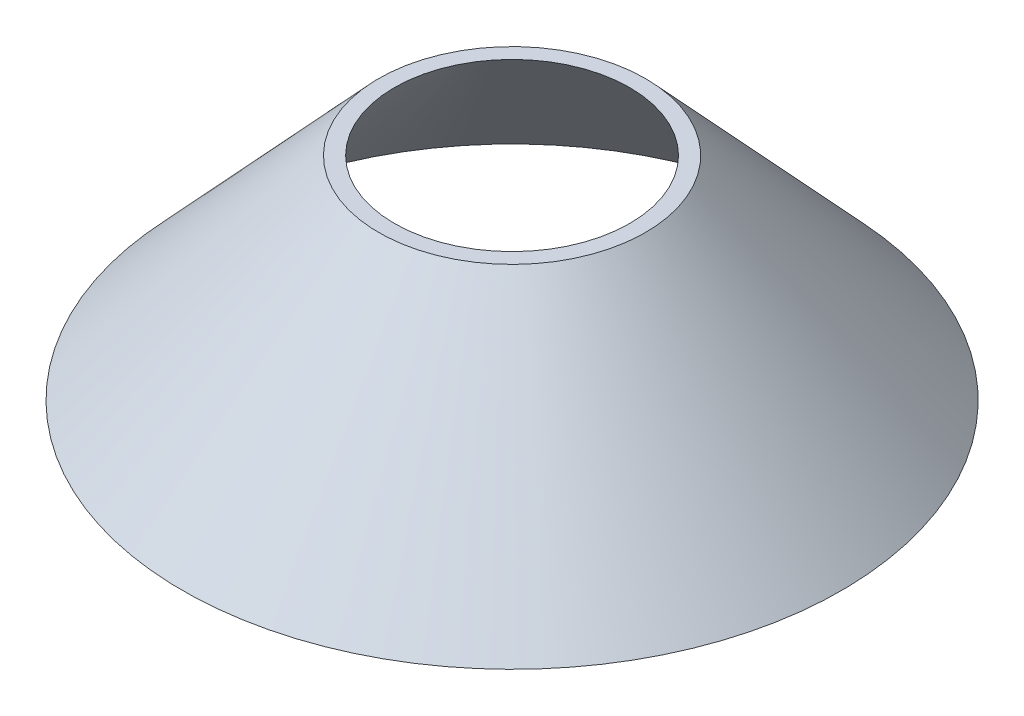
ISO-10303-21;
HEADER;
FILE_DESCRIPTION(('STEP AP214'),'2;1');
FILE_NAME('part.step','',(''),(''),'','','');
FILE_SCHEMA(('AUTOMOTIVE_DESIGN { 1 0 10303 214 1 1 1 1 }'));
ENDSEC;
DATA;
#1=APPLICATION_CONTEXT('core data for automotive mechanical design processes');
#2=APPLICATION_PROTOCOL_DEFINITION('international standard','automotive_design',2000,#1);
#3=PRODUCT_CONTEXT('',#1,'mechanical');
#4=PRODUCT('Part','Part','',(#3));
#5=PRODUCT_RELATED_PRODUCT_CATEGORY('part','',(#4));
#6=PRODUCT_DEFINITION_FORMATION('','',#4);
#7=PRODUCT_DEFINITION_CONTEXT('part definition',#1,'design');
#8=PRODUCT_DEFINITION('design','',#6,#7);
#9=PRODUCT_DEFINITION_SHAPE('','',#8);
#10=(LENGTH_UNIT() NAMED_UNIT(*) SI_UNIT(.MILLI.,.METRE.));
#11=(NAMED_UNIT(*) PLANE_ANGLE_UNIT() SI_UNIT($,.RADIAN.));
#12=(NAMED_UNIT(*) SI_UNIT($,.STERADIAN.) SOLID_ANGLE_UNIT());
#13=UNCERTAINTY_MEASURE_WITH_UNIT(LENGTH_MEASURE(1.E-05),#10,'distance_accuracy_value','');
#14=(GEOMETRIC_REPRESENTATION_CONTEXT(3) GLOBAL_UNCERTAINTY_ASSIGNED_CONTEXT((#13)) GLOBAL_UNIT_ASSIGNED_CONTEXT((#10,
#11,#12)) REPRESENTATION_CONTEXT('',''));
#15=CARTESIAN_POINT('',(0.,0.,0.));
#16=DIRECTION('',(0.,0.,1.));
#17=DIRECTION('',(1.,0.,0.));
#18=AXIS2_PLACEMENT_3D('',#15,#16,#17);
#19=CARTESIAN_POINT('',(0.,34.3044318181818,0.));
#20=DIRECTION('',(0.,-1.,0.));
#21=DIRECTION('',(0.,0.,-1.));
#22=AXIS2_PLACEMENT_3D('',#19,#20,#21);
#23=CONICAL_SURFACE('',#22,19.05,0.746745804879853);
#24=CARTESIAN_POINT('',(0.,0.,0.));
#25=DIRECTION('',(0.,-1.,0.));
#26=DIRECTION('',(0.,0.,-1.));
#27=AXIS2_PLACEMENT_3D('',#24,#25,#26);
#28=CIRCLE('',#27,50.8);
#29=CARTESIAN_POINT('',(0.,0.,-50.8));
#30=VERTEX_POINT('',#29);
#31=EDGE_CURVE('E58',#30,#30,#28,.T.);
#32=ORIENTED_EDGE('',*,*,#31,.T.);
#33=EDGE_LOOP('',(#32));
#34=FACE_BOUND('',#33,.T.);
#35=CARTESIAN_POINT('',(0.,34.3044318181818,0.));
#36=DIRECTION('',(0.,-1.,0.));
#37=DIRECTION('',(0.,0.,-1.));
#38=AXIS2_PLACEMENT_3D('',#35,#36,#37);
#39=CIRCLE('',#38,19.05);
#40=CARTESIAN_POINT('',(0.,34.3044318181818,-19.05));
#41=VERTEX_POINT('',#40);
#42=EDGE_CURVE('E10',#41,#41,#39,.T.);
#43=ORIENTED_EDGE('',*,*,#42,.F.);
#44=EDGE_LOOP('',(#43));
#45=FACE_BOUND('',#44,.T.);
#46=ADVANCED_FACE('F41',(#34,#45),#23,.F.);
#47=CARTESIAN_POINT('',(19.05,34.3044318181818,0.));
#48=DIRECTION('',(0.,1.,0.));
#49=DIRECTION('',(0.,0.,1.));
#50=AXIS2_PLACEMENT_3D('',#47,#48,#49);
#51=PLANE('',#50);
#52=ORIENTED_EDGE('',*,*,#42,.T.);
#53=EDGE_LOOP('',(#52));
#54=FACE_BOUND('',#53,.T.);
#55=CARTESIAN_POINT('',(0.,34.3044318181818,0.));
#56=DIRECTION('',(0.,-1.,0.));
#57=DIRECTION('',(0.,0.,-1.));
#58=AXIS2_PLACEMENT_3D('',#55,#56,#57);
#59=CIRCLE('',#58,21.59);
#60=CARTESIAN_POINT('',(0.,34.3044318181818,-21.59));
#61=VERTEX_POINT('',#60);
#62=EDGE_CURVE('E48',#61,#61,#59,.T.);
#63=ORIENTED_EDGE('',*,*,#62,.F.);
#64=EDGE_LOOP('',(#63));
#65=FACE_BOUND('',#64,.T.);
#66=ADVANCED_FACE('F75',(#54,#65),#51,.T.);
#67=CARTESIAN_POINT('',(0.,0.,0.));
#68=DIRECTION('',(0.,-1.,0.));
#69=DIRECTION('',(0.,0.,-1.));
#70=AXIS2_PLACEMENT_3D('',#67,#68,#69);
#71=CONICAL_SURFACE('',#70,53.34,0.746745804879853);
#72=ORIENTED_EDGE('',*,*,#62,.T.);
#73=EDGE_LOOP('',(#72));
#74=FACE_BOUND('',#73,.T.);
#75=CARTESIAN_POINT('',(0.,0.,0.));
#76=DIRECTION('',(0.,-1.,0.));
#77=DIRECTION('',(0.,0.,-1.));
#78=AXIS2_PLACEMENT_3D('',#75,#76,#77);
#79=CIRCLE('',#78,53.34);
#80=CARTESIAN_POINT('',(0.,0.,-53.34));
#81=VERTEX_POINT('',#80);
#82=EDGE_CURVE('E53',#81,#81,#79,.T.);
#83=ORIENTED_EDGE('',*,*,#82,.F.);
#84=EDGE_LOOP('',(#83));
#85=FACE_BOUND('',#84,.T.);
#86=ADVANCED_FACE('F69',(#74,#85),#71,.T.);
#87=CARTESIAN_POINT('',(53.34,0.,0.));
#88=DIRECTION('',(0.,-1.,0.));
#89=DIRECTION('',(0.,0.,-1.));
#90=AXIS2_PLACEMENT_3D('',#87,#88,#89);
#91=PLANE('',#90);
#92=ORIENTED_EDGE('',*,*,#82,.T.);
#93=EDGE_LOOP('',(#92));
#94=FACE_BOUND('',#93,.T.);
#95=ORIENTED_EDGE('',*,*,#31,.F.);
#96=EDGE_LOOP('',(#95));
#97=FACE_BOUND('',#96,.T.);
#98=ADVANCED_FACE('F67',(#94,#97),#91,.T.);
#99=CLOSED_SHELL('',(#46,#66,#86,#98));
#100=MANIFOLD_SOLID_BREP('B2',#99);
#101=ADVANCED_BREP_SHAPE_REPRESENTATION('',(#18,#100),#14);
#102=SHAPE_DEFINITION_REPRESENTATION(#9,#101);
ENDSEC;
END-ISO-10303-21;
